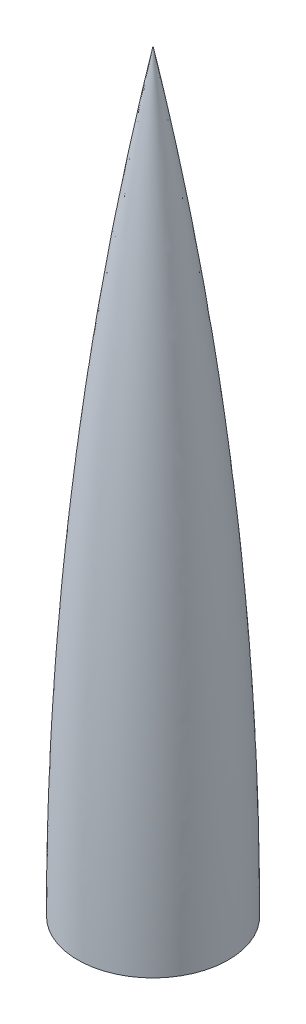
ISO-10303-21;
HEADER;
FILE_DESCRIPTION(('STEP AP214'),'2;1');
FILE_NAME('part.step','',(''),(''),'','','');
FILE_SCHEMA(('AUTOMOTIVE_DESIGN { 1 0 10303 214 1 1 1 1 }'));
ENDSEC;
DATA;
#1=APPLICATION_CONTEXT('core data for automotive mechanical design processes');
#2=APPLICATION_PROTOCOL_DEFINITION('international standard','automotive_design',2000,#1);
#3=PRODUCT_CONTEXT('',#1,'mechanical');
#4=PRODUCT('Part','Part','',(#3));
#5=PRODUCT_RELATED_PRODUCT_CATEGORY('part','',(#4));
#6=PRODUCT_DEFINITION_FORMATION('','',#4);
#7=PRODUCT_DEFINITION_CONTEXT('part definition',#1,'design');
#8=PRODUCT_DEFINITION('design','',#6,#7);
#9=PRODUCT_DEFINITION_SHAPE('','',#8);
#10=(LENGTH_UNIT() NAMED_UNIT(*) SI_UNIT(.MILLI.,.METRE.));
#11=(NAMED_UNIT(*) PLANE_ANGLE_UNIT() SI_UNIT($,.RADIAN.));
#12=(NAMED_UNIT(*) SI_UNIT($,.STERADIAN.) SOLID_ANGLE_UNIT());
#13=UNCERTAINTY_MEASURE_WITH_UNIT(LENGTH_MEASURE(1.E-05),#10,'distance_accuracy_value','');
#14=(GEOMETRIC_REPRESENTATION_CONTEXT(3) GLOBAL_UNCERTAINTY_ASSIGNED_CONTEXT((#13)) GLOBAL_UNIT_ASSIGNED_CONTEXT((#10,
#11,#12)) REPRESENTATION_CONTEXT('',''));
#15=CARTESIAN_POINT('',(0.,0.,0.));
#16=DIRECTION('',(0.,0.,1.));
#17=DIRECTION('',(1.,0.,0.));
#18=AXIS2_PLACEMENT_3D('',#15,#16,#17);
#19=CARTESIAN_POINT('',(0.,783.59,0.));
#20=CARTESIAN_POINT('',(0.,741.385770299536,-8.50990439598333));
#21=CARTESIAN_POINT('',(0.,640.155812371866,-27.2554130492915));
#22=CARTESIAN_POINT('',(0.,487.684682799424,-49.3557964214666));
#23=CARTESIAN_POINT('',(0.,268.912325010193,-71.7541529702477));
#24=CARTESIAN_POINT('',(0.,108.921598753228,-78.3407160238819));
#25=CARTESIAN_POINT('',(0.,0.,-78.359));
#26=B_SPLINE_CURVE_WITH_KNOTS('',3,(#19,#20,#21,#22,#23,#24,#25),.UNSPECIFIED.,.F.,.F.,(4,1,1,1,
4),(0.,0.163751137885177,0.391527949083297,0.585753649742256,1.),.UNSPECIFIED.);
#27=CARTESIAN_POINT('',(0.,0.,0.));
#28=DIRECTION('',(0.,-1.,0.));
#29=AXIS1_PLACEMENT('',#27,#28);
#30=SURFACE_OF_REVOLUTION('',#26,#29);
#31=CARTESIAN_POINT('',(0.,0.,0.));
#32=DIRECTION('',(0.,-1.,0.));
#33=DIRECTION('',(0.,0.,-1.));
#34=AXIS2_PLACEMENT_3D('',#31,#32,#33);
#35=CIRCLE('',#34,78.359);
#36=CARTESIAN_POINT('',(0.,0.,-78.359));
#37=VERTEX_POINT('',#36);
#38=EDGE_CURVE('E43',#37,#37,#35,.T.);
#39=ORIENTED_EDGE('',*,*,#38,.F.);
#40=EDGE_LOOP('',(#39));
#41=FACE_BOUND('',#40,.T.);
#42=CARTESIAN_POINT('',(0.,783.59,0.));
#43=VERTEX_POINT('',#42);
#44=VERTEX_LOOP('',#43);
#45=FACE_BOUND('',#44,.T.);
#46=ADVANCED_FACE('F35',(#41,#45),#30,.T.);
#47=CARTESIAN_POINT('',(0.,774.21634491636,0.));
#48=CARTESIAN_POINT('',(0.,738.199337233266,-7.56587479736151));
#49=CARTESIAN_POINT('',(0.,692.331028198707,-15.1524289177301));
#50=CARTESIAN_POINT('',(0.,594.332041910086,-30.4185763502655));
#51=CARTESIAN_POINT('',(0.,481.348809619658,-45.6115522229499));
#52=CARTESIAN_POINT('',(0.,269.568394663959,-71.9335015262554));
#53=CARTESIAN_POINT('',(0.,108.646566593788,-75.6790921839151));
#54=CARTESIAN_POINT('',(0.,-2.13315287050251E-13,-76.2000000000001));
#55=B_SPLINE_CURVE_WITH_KNOTS('',3,(#47,#48,#49,#50,#51,#52,#53,#54),.UNSPECIFIED.,.F.,.F.,(4,1,
1,1,1,4),(0.,0.143276006346899,0.176214492852243,0.383719210444227,0.580852042843237,1.),.UNSPECIFIED.);
#56=CARTESIAN_POINT('',(0.,0.,0.));
#57=DIRECTION('',(0.,-1.,0.));
#58=AXIS1_PLACEMENT('',#56,#57);
#59=SURFACE_OF_REVOLUTION('',#55,#58);
#60=CARTESIAN_POINT('',(0.,0.,0.));
#61=DIRECTION('',(0.,-1.,0.));
#62=DIRECTION('',(0.,0.,-1.));
#63=AXIS2_PLACEMENT_3D('',#60,#61,#62);
#64=CIRCLE('',#63,76.2000000000001);
#65=CARTESIAN_POINT('',(0.,0.,-76.2000000000001));
#66=VERTEX_POINT('',#65);
#67=EDGE_CURVE('E11',#66,#66,#64,.T.);
#68=ORIENTED_EDGE('',*,*,#67,.T.);
#69=EDGE_LOOP('',(#68));
#70=FACE_BOUND('',#69,.T.);
#71=CARTESIAN_POINT('',(0.,774.21634491636,0.));
#72=VERTEX_POINT('',#71);
#73=VERTEX_LOOP('',#72);
#74=FACE_BOUND('',#73,.T.);
#75=ADVANCED_FACE('F50',(#70,#74),#59,.F.);
#76=CARTESIAN_POINT('',(0.,0.,0.));
#77=DIRECTION('',(0.,1.,0.));
#78=DIRECTION('',(0.,0.,1.));
#79=AXIS2_PLACEMENT_3D('',#76,#77,#78);
#80=PLANE('',#79);
#81=ORIENTED_EDGE('',*,*,#67,.F.);
#82=EDGE_LOOP('',(#81));
#83=FACE_BOUND('',#82,.T.);
#84=ORIENTED_EDGE('',*,*,#38,.T.);
#85=EDGE_LOOP('',(#84));
#86=FACE_BOUND('',#85,.T.);
#87=ADVANCED_FACE('F55',(#83,#86),#80,.F.);
#88=CLOSED_SHELL('',(#46,#75,#87));
#89=MANIFOLD_SOLID_BREP('B2',#88);
#90=ADVANCED_BREP_SHAPE_REPRESENTATION('',(#18,#89),#14);
#91=SHAPE_DEFINITION_REPRESENTATION(#9,#90);
ENDSEC;
END-ISO-10303-21;
